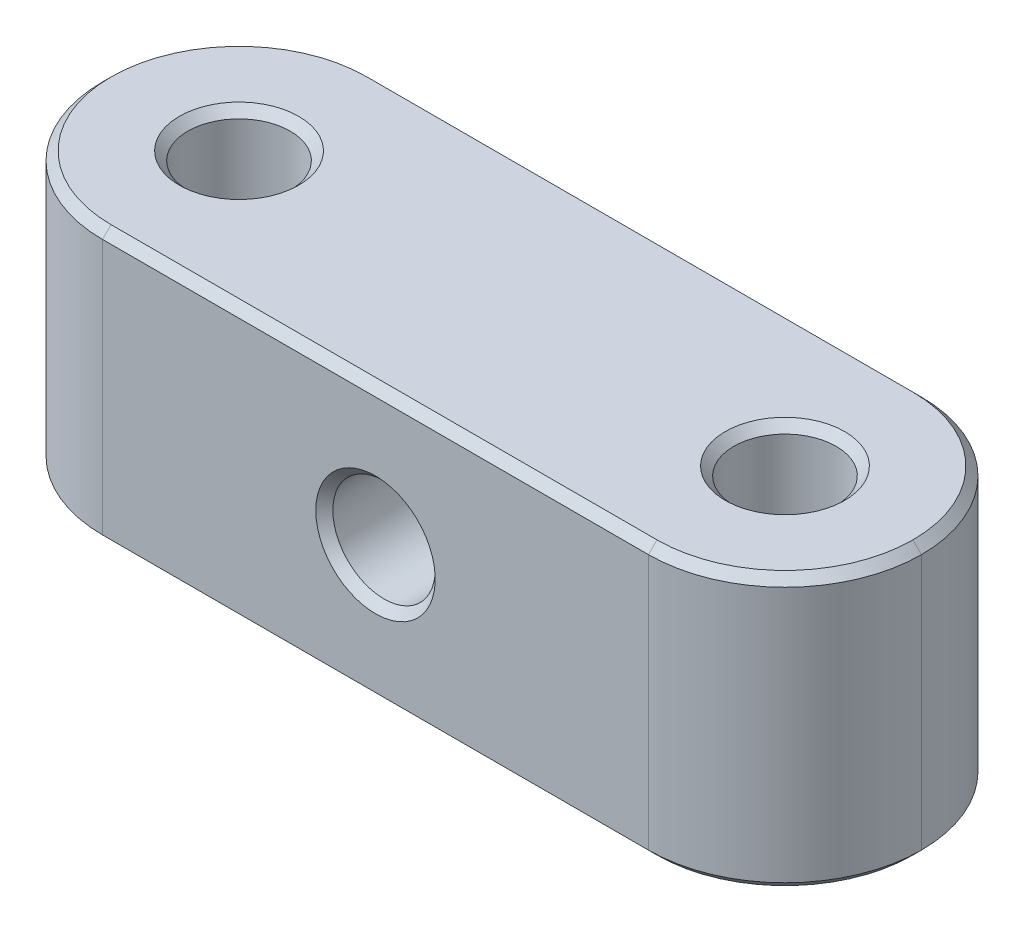
ISO-10303-21;
HEADER;
FILE_DESCRIPTION(('STEP AP214'),'2;1');
FILE_NAME('part.step','',(''),(''),'','','');
FILE_SCHEMA(('AUTOMOTIVE_DESIGN { 1 0 10303 214 1 1 1 1 }'));
ENDSEC;
DATA;
#1=APPLICATION_CONTEXT('core data for automotive mechanical design processes');
#2=APPLICATION_PROTOCOL_DEFINITION('international standard','automotive_design',2000,#1);
#3=PRODUCT_CONTEXT('',#1,'mechanical');
#4=PRODUCT('Part','Part','',(#3));
#5=PRODUCT_RELATED_PRODUCT_CATEGORY('part','',(#4));
#6=PRODUCT_DEFINITION_FORMATION('','',#4);
#7=PRODUCT_DEFINITION_CONTEXT('part definition',#1,'design');
#8=PRODUCT_DEFINITION('design','',#6,#7);
#9=PRODUCT_DEFINITION_SHAPE('','',#8);
#10=(LENGTH_UNIT() NAMED_UNIT(*) SI_UNIT(.MILLI.,.METRE.));
#11=(NAMED_UNIT(*) PLANE_ANGLE_UNIT() SI_UNIT($,.RADIAN.));
#12=(NAMED_UNIT(*) SI_UNIT($,.STERADIAN.) SOLID_ANGLE_UNIT());
#13=UNCERTAINTY_MEASURE_WITH_UNIT(LENGTH_MEASURE(1.E-05),#10,'distance_accuracy_value','');
#14=(GEOMETRIC_REPRESENTATION_CONTEXT(3) GLOBAL_UNCERTAINTY_ASSIGNED_CONTEXT((#13)) GLOBAL_UNIT_ASSIGNED_CONTEXT((#10,
#11,#12)) REPRESENTATION_CONTEXT('',''));
#15=CARTESIAN_POINT('',(0.,0.,0.));
#16=DIRECTION('',(0.,0.,1.));
#17=DIRECTION('',(1.,0.,0.));
#18=AXIS2_PLACEMENT_3D('',#15,#16,#17);
#19=CARTESIAN_POINT('',(0.,12.7,0.));
#20=DIRECTION('',(0.,-1.,0.));
#21=DIRECTION('',(0.,0.,-1.));
#22=AXIS2_PLACEMENT_3D('',#19,#20,#21);
#23=PLANE('',#22);
#24=CARTESIAN_POINT('',(31.75,12.7,-6.35));
#25=DIRECTION('',(0.,-1.,0.));
#26=DIRECTION('',(0.,0.,-1.));
#27=AXIS2_PLACEMENT_3D('',#24,#25,#26);
#28=CIRCLE('',#27,2.77812499999999);
#29=CARTESIAN_POINT('',(31.75,12.7,-9.12812499999999));
#30=VERTEX_POINT('',#29);
#31=EDGE_CURVE('E11',#30,#30,#28,.T.);
#32=ORIENTED_EDGE('',*,*,#31,.T.);
#33=EDGE_LOOP('',(#32));
#34=FACE_BOUND('',#33,.T.);
#35=CARTESIAN_POINT('',(6.35,12.7,-6.35));
#36=DIRECTION('',(0.,-1.,0.));
#37=DIRECTION('',(0.,0.,-1.));
#38=AXIS2_PLACEMENT_3D('',#35,#36,#37);
#39=CIRCLE('',#38,2.778125);
#40=CARTESIAN_POINT('',(6.35,12.7,-9.128125));
#41=VERTEX_POINT('',#40);
#42=EDGE_CURVE('E54',#41,#41,#39,.T.);
#43=ORIENTED_EDGE('',*,*,#42,.T.);
#44=EDGE_LOOP('',(#43));
#45=FACE_BOUND('',#44,.T.);
#46=CARTESIAN_POINT('',(31.75,12.7,-6.35));
#47=DIRECTION('',(0.,-1.,0.));
#48=DIRECTION('',(0.,0.,-1.));
#49=AXIS2_PLACEMENT_3D('',#46,#47,#48);
#50=CIRCLE('',#49,5.95312500000001);
#51=CARTESIAN_POINT('',(31.75,12.7,-0.396874999999991));
#52=VERTEX_POINT('',#51);
#53=CARTESIAN_POINT('',(37.703125,12.7,-6.35));
#54=VERTEX_POINT('',#53);
#55=EDGE_CURVE('E62',#52,#54,#50,.F.);
#56=ORIENTED_EDGE('',*,*,#55,.T.);
#57=CARTESIAN_POINT('',(31.75,12.7,-6.35));
#58=DIRECTION('',(0.,-1.,0.));
#59=DIRECTION('',(0.,0.,-1.));
#60=AXIS2_PLACEMENT_3D('',#57,#58,#59);
#61=CIRCLE('',#60,5.95312500000001);
#62=CARTESIAN_POINT('',(31.75,12.7,-12.303125));
#63=VERTEX_POINT('',#62);
#64=EDGE_CURVE('E216',#54,#63,#61,.F.);
#65=ORIENTED_EDGE('',*,*,#64,.T.);
#66=DIRECTION('',(-1.,0.,0.));
#67=VECTOR('',#66,1.);
#68=CARTESIAN_POINT('',(0.,12.7,-12.303125));
#69=LINE('',#68,#67);
#70=CARTESIAN_POINT('',(6.35,12.7,-12.303125));
#71=VERTEX_POINT('',#70);
#72=EDGE_CURVE('E229',#63,#71,#69,.T.);
#73=ORIENTED_EDGE('',*,*,#72,.T.);
#74=CARTESIAN_POINT('',(6.35,12.7,-6.35));
#75=DIRECTION('',(0.,-1.,0.));
#76=DIRECTION('',(0.,0.,-1.));
#77=AXIS2_PLACEMENT_3D('',#74,#75,#76);
#78=CIRCLE('',#77,5.95312500000001);
#79=CARTESIAN_POINT('',(0.396874999999991,12.7,-6.35));
#80=VERTEX_POINT('',#79);
#81=EDGE_CURVE('E226',#71,#80,#78,.F.);
#82=ORIENTED_EDGE('',*,*,#81,.T.);
#83=CARTESIAN_POINT('',(6.35,12.7,-6.35));
#84=DIRECTION('',(0.,-1.,0.));
#85=DIRECTION('',(0.,0.,-1.));
#86=AXIS2_PLACEMENT_3D('',#83,#84,#85);
#87=CIRCLE('',#86,5.95312500000001);
#88=CARTESIAN_POINT('',(6.35,12.7,-0.396874999999991));
#89=VERTEX_POINT('',#88);
#90=EDGE_CURVE('E223',#80,#89,#87,.F.);
#91=ORIENTED_EDGE('',*,*,#90,.T.);
#92=DIRECTION('',(1.,0.,0.));
#93=VECTOR('',#92,1.);
#94=CARTESIAN_POINT('',(0.,12.7,-0.396874999999991));
#95=LINE('',#94,#93);
#96=EDGE_CURVE('E67',#89,#52,#95,.T.);
#97=ORIENTED_EDGE('',*,*,#96,.T.);
#98=EDGE_LOOP('',(#56,#65,#73,#82,#91,#97));
#99=FACE_BOUND('',#98,.T.);
#100=ADVANCED_FACE('F43',(#34,#45,#99),#23,.F.);
#101=CARTESIAN_POINT('',(0.,0.,0.));
#102=DIRECTION('',(0.,-1.,0.));
#103=DIRECTION('',(0.,0.,-1.));
#104=AXIS2_PLACEMENT_3D('',#101,#102,#103);
#105=PLANE('',#104);
#106=CARTESIAN_POINT('',(31.75,0.,-6.35));
#107=DIRECTION('',(0.,-1.,0.));
#108=DIRECTION('',(0.,0.,-1.));
#109=AXIS2_PLACEMENT_3D('',#106,#107,#108);
#110=CIRCLE('',#109,2.778125);
#111=CARTESIAN_POINT('',(31.75,0.,-9.128125));
#112=VERTEX_POINT('',#111);
#113=EDGE_CURVE('E268',#112,#112,#110,.F.);
#114=ORIENTED_EDGE('',*,*,#113,.T.);
#115=EDGE_LOOP('',(#114));
#116=FACE_BOUND('',#115,.T.);
#117=CARTESIAN_POINT('',(31.75,0.,-6.35));
#118=DIRECTION('',(0.,-1.,0.));
#119=DIRECTION('',(0.,0.,-1.));
#120=AXIS2_PLACEMENT_3D('',#117,#118,#119);
#121=CIRCLE('',#120,5.953125);
#122=CARTESIAN_POINT('',(37.703125,0.,-6.35));
#123=VERTEX_POINT('',#122);
#124=CARTESIAN_POINT('',(31.75,0.,-0.396874999999996));
#125=VERTEX_POINT('',#124);
#126=EDGE_CURVE('E276',#123,#125,#121,.T.);
#127=ORIENTED_EDGE('',*,*,#126,.T.);
#128=DIRECTION('',(-1.,0.,0.));
#129=VECTOR('',#128,1.);
#130=CARTESIAN_POINT('',(6.35,0.,-0.396874999999995));
#131=LINE('',#130,#129);
#132=CARTESIAN_POINT('',(6.35,0.,-0.396874999999995));
#133=VERTEX_POINT('',#132);
#134=EDGE_CURVE('E272',#125,#133,#131,.T.);
#135=ORIENTED_EDGE('',*,*,#134,.T.);
#136=CARTESIAN_POINT('',(6.35,0.,-6.35));
#137=DIRECTION('',(0.,-1.,0.));
#138=DIRECTION('',(0.,0.,-1.));
#139=AXIS2_PLACEMENT_3D('',#136,#137,#138);
#140=CIRCLE('',#139,5.95312500000001);
#141=CARTESIAN_POINT('',(0.396874999999995,0.,-6.35));
#142=VERTEX_POINT('',#141);
#143=EDGE_CURVE('E288',#133,#142,#140,.T.);
#144=ORIENTED_EDGE('',*,*,#143,.T.);
#145=CARTESIAN_POINT('',(6.35,0.,-6.35));
#146=DIRECTION('',(0.,-1.,0.));
#147=DIRECTION('',(0.,0.,-1.));
#148=AXIS2_PLACEMENT_3D('',#145,#146,#147);
#149=CIRCLE('',#148,5.95312500000001);
#150=CARTESIAN_POINT('',(6.35,0.,-12.303125));
#151=VERTEX_POINT('',#150);
#152=EDGE_CURVE('E285',#142,#151,#149,.T.);
#153=ORIENTED_EDGE('',*,*,#152,.T.);
#154=DIRECTION('',(1.,0.,0.));
#155=VECTOR('',#154,1.);
#156=CARTESIAN_POINT('',(31.75,0.,-12.303125));
#157=LINE('',#156,#155);
#158=CARTESIAN_POINT('',(31.75,0.,-12.303125));
#159=VERTEX_POINT('',#158);
#160=EDGE_CURVE('E282',#151,#159,#157,.T.);
#161=ORIENTED_EDGE('',*,*,#160,.T.);
#162=CARTESIAN_POINT('',(31.75,0.,-6.35));
#163=DIRECTION('',(0.,-1.,0.));
#164=DIRECTION('',(0.,0.,-1.));
#165=AXIS2_PLACEMENT_3D('',#162,#163,#164);
#166=CIRCLE('',#165,5.953125);
#167=EDGE_CURVE('E279',#159,#123,#166,.T.);
#168=ORIENTED_EDGE('',*,*,#167,.T.);
#169=EDGE_LOOP('',(#127,#135,#144,#153,#161,#168));
#170=FACE_BOUND('',#169,.T.);
#171=CARTESIAN_POINT('',(6.35,0.,-6.35));
#172=DIRECTION('',(0.,-1.,0.));
#173=DIRECTION('',(0.,0.,-1.));
#174=AXIS2_PLACEMENT_3D('',#171,#172,#173);
#175=CIRCLE('',#174,2.778125);
#176=CARTESIAN_POINT('',(6.35,0.,-9.128125));
#177=VERTEX_POINT('',#176);
#178=EDGE_CURVE('E291',#177,#177,#175,.F.);
#179=ORIENTED_EDGE('',*,*,#178,.T.);
#180=EDGE_LOOP('',(#179));
#181=FACE_BOUND('',#180,.T.);
#182=ADVANCED_FACE('F355',(#116,#170,#181),#105,.T.);
#183=CARTESIAN_POINT('',(0.,12.7,0.));
#184=DIRECTION('',(0.,0.,-1.));
#185=DIRECTION('',(-1.,0.,0.));
#186=AXIS2_PLACEMENT_3D('',#183,#184,#185);
#187=PLANE('',#186);
#188=CARTESIAN_POINT('',(19.05,6.35,0.));
#189=DIRECTION('',(0.,0.,-1.));
#190=DIRECTION('',(-1.,0.,0.));
#191=AXIS2_PLACEMENT_3D('',#188,#189,#190);
#192=CIRCLE('',#191,2.77812500000001);
#193=CARTESIAN_POINT('',(16.271875,6.35,0.));
#194=VERTEX_POINT('',#193);
#195=EDGE_CURVE('E313',#194,#194,#192,.T.);
#196=ORIENTED_EDGE('',*,*,#195,.T.);
#197=EDGE_LOOP('',(#196));
#198=FACE_BOUND('',#197,.T.);
#199=DIRECTION('',(0.,-1.,0.));
#200=VECTOR('',#199,1.);
#201=CARTESIAN_POINT('',(6.35,12.7,0.));
#202=LINE('',#201,#200);
#203=CARTESIAN_POINT('',(6.35,12.303125,0.));
#204=VERTEX_POINT('',#203);
#205=CARTESIAN_POINT('',(6.35,0.396874999999998,0.));
#206=VERTEX_POINT('',#205);
#207=EDGE_CURVE('E141',#204,#206,#202,.T.);
#208=ORIENTED_EDGE('',*,*,#207,.T.);
#209=DIRECTION('',(1.,0.,0.));
#210=VECTOR('',#209,1.);
#211=CARTESIAN_POINT('',(31.75,0.396874999999998,0.));
#212=LINE('',#211,#210);
#213=CARTESIAN_POINT('',(31.75,0.396874999999998,0.));
#214=VERTEX_POINT('',#213);
#215=EDGE_CURVE('E149',#206,#214,#212,.T.);
#216=ORIENTED_EDGE('',*,*,#215,.T.);
#217=DIRECTION('',(0.,-1.,0.));
#218=VECTOR('',#217,1.);
#219=CARTESIAN_POINT('',(31.75,12.7,0.));
#220=LINE('',#219,#218);
#221=CARTESIAN_POINT('',(31.75,12.303125,0.));
#222=VERTEX_POINT('',#221);
#223=EDGE_CURVE('E144',#214,#222,#220,.F.);
#224=ORIENTED_EDGE('',*,*,#223,.T.);
#225=DIRECTION('',(-1.,0.,0.));
#226=VECTOR('',#225,1.);
#227=CARTESIAN_POINT('',(0.,12.303125,0.));
#228=LINE('',#227,#226);
#229=EDGE_CURVE('E137',#222,#204,#228,.T.);
#230=ORIENTED_EDGE('',*,*,#229,.T.);
#231=EDGE_LOOP('',(#208,#216,#224,#230));
#232=FACE_BOUND('',#231,.T.);
#233=ADVANCED_FACE('F139',(#198,#232),#187,.F.);
#234=CARTESIAN_POINT('',(0.,12.7,-12.7));
#235=DIRECTION('',(0.,0.,1.));
#236=DIRECTION('',(1.,0.,0.));
#237=AXIS2_PLACEMENT_3D('',#234,#235,#236);
#238=PLANE('',#237);
#239=CARTESIAN_POINT('',(19.05,6.35,-12.7));
#240=DIRECTION('',(0.,0.,1.));
#241=DIRECTION('',(1.,0.,0.));
#242=AXIS2_PLACEMENT_3D('',#239,#240,#241);
#243=CIRCLE('',#242,2.778125);
#244=CARTESIAN_POINT('',(21.828125,6.35,-12.7));
#245=VERTEX_POINT('',#244);
#246=EDGE_CURVE('E295',#245,#245,#243,.T.);
#247=ORIENTED_EDGE('',*,*,#246,.T.);
#248=EDGE_LOOP('',(#247));
#249=FACE_BOUND('',#248,.T.);
#250=DIRECTION('',(0.,-1.,0.));
#251=VECTOR('',#250,1.);
#252=CARTESIAN_POINT('',(31.75,12.7,-12.7));
#253=LINE('',#252,#251);
#254=CARTESIAN_POINT('',(31.75,12.303125,-12.7));
#255=VERTEX_POINT('',#254);
#256=CARTESIAN_POINT('',(31.75,0.396874999999998,-12.7));
#257=VERTEX_POINT('',#256);
#258=EDGE_CURVE('E324',#255,#257,#253,.T.);
#259=ORIENTED_EDGE('',*,*,#258,.T.);
#260=DIRECTION('',(-1.,0.,0.));
#261=VECTOR('',#260,1.);
#262=CARTESIAN_POINT('',(6.35,0.396874999999998,-12.7));
#263=LINE('',#262,#261);
#264=CARTESIAN_POINT('',(6.35,0.396874999999998,-12.7));
#265=VERTEX_POINT('',#264);
#266=EDGE_CURVE('E299',#257,#265,#263,.T.);
#267=ORIENTED_EDGE('',*,*,#266,.T.);
#268=DIRECTION('',(0.,-1.,0.));
#269=VECTOR('',#268,1.);
#270=CARTESIAN_POINT('',(6.35,12.7,-12.7));
#271=LINE('',#270,#269);
#272=CARTESIAN_POINT('',(6.35,12.303125,-12.7));
#273=VERTEX_POINT('',#272);
#274=EDGE_CURVE('E328',#265,#273,#271,.F.);
#275=ORIENTED_EDGE('',*,*,#274,.T.);
#276=DIRECTION('',(1.,0.,0.));
#277=VECTOR('',#276,1.);
#278=CARTESIAN_POINT('',(0.,12.303125,-12.7));
#279=LINE('',#278,#277);
#280=EDGE_CURVE('E302',#273,#255,#279,.T.);
#281=ORIENTED_EDGE('',*,*,#280,.T.);
#282=EDGE_LOOP('',(#259,#267,#275,#281));
#283=FACE_BOUND('',#282,.T.);
#284=ADVANCED_FACE('F337',(#249,#283),#238,.F.);
#285=CARTESIAN_POINT('',(6.35,12.7,-6.35));
#286=DIRECTION('',(0.,-1.,0.));
#287=DIRECTION('',(0.,0.,-1.));
#288=AXIS2_PLACEMENT_3D('',#285,#286,#287);
#289=CYLINDRICAL_SURFACE('',#288,2.38125);
#290=CARTESIAN_POINT('',(6.35,0.396875,-6.35));
#291=DIRECTION('',(0.,-1.,0.));
#292=DIRECTION('',(0.,0.,-1.));
#293=AXIS2_PLACEMENT_3D('',#290,#291,#292);
#294=CIRCLE('',#293,2.38125);
#295=CARTESIAN_POINT('',(6.35,0.396875,-8.73125));
#296=VERTEX_POINT('',#295);
#297=EDGE_CURVE('E232',#296,#296,#294,.T.);
#298=ORIENTED_EDGE('',*,*,#297,.T.);
#299=EDGE_LOOP('',(#298));
#300=FACE_BOUND('',#299,.T.);
#301=CARTESIAN_POINT('',(6.35,12.303125,-6.35));
#302=DIRECTION('',(0.,-1.,0.));
#303=DIRECTION('',(0.,0.,-1.));
#304=AXIS2_PLACEMENT_3D('',#301,#302,#303);
#305=CIRCLE('',#304,2.38125);
#306=CARTESIAN_POINT('',(6.35,12.303125,-8.73125));
#307=VERTEX_POINT('',#306);
#308=EDGE_CURVE('E236',#307,#307,#305,.F.);
#309=ORIENTED_EDGE('',*,*,#308,.T.);
#310=EDGE_LOOP('',(#309));
#311=FACE_BOUND('',#310,.T.);
#312=ADVANCED_FACE('F407',(#300,#311),#289,.F.);
#313=CARTESIAN_POINT('',(31.75,12.7,-6.35));
#314=DIRECTION('',(0.,-1.,0.));
#315=DIRECTION('',(0.,0.,-1.));
#316=AXIS2_PLACEMENT_3D('',#313,#314,#315);
#317=CYLINDRICAL_SURFACE('',#316,2.38125);
#318=CARTESIAN_POINT('',(31.75,0.396875000000001,-6.35));
#319=DIRECTION('',(0.,-1.,0.));
#320=DIRECTION('',(0.,0.,-1.));
#321=AXIS2_PLACEMENT_3D('',#318,#319,#320);
#322=CIRCLE('',#321,2.38125);
#323=CARTESIAN_POINT('',(31.75,0.396875000000001,-8.73125));
#324=VERTEX_POINT('',#323);
#325=EDGE_CURVE('E260',#324,#324,#322,.T.);
#326=ORIENTED_EDGE('',*,*,#325,.T.);
#327=EDGE_LOOP('',(#326));
#328=FACE_BOUND('',#327,.T.);
#329=CARTESIAN_POINT('',(31.75,12.303125,-6.35));
#330=DIRECTION('',(0.,-1.,0.));
#331=DIRECTION('',(0.,0.,-1.));
#332=AXIS2_PLACEMENT_3D('',#329,#330,#331);
#333=CIRCLE('',#332,2.38125);
#334=CARTESIAN_POINT('',(31.75,12.303125,-8.73125));
#335=VERTEX_POINT('',#334);
#336=EDGE_CURVE('E264',#335,#335,#333,.F.);
#337=ORIENTED_EDGE('',*,*,#336,.T.);
#338=EDGE_LOOP('',(#337));
#339=FACE_BOUND('',#338,.T.);
#340=ADVANCED_FACE('F613',(#328,#339),#317,.F.);
#341=CARTESIAN_POINT('',(19.05,6.35,-12.7));
#342=DIRECTION('',(0.,0.,1.));
#343=DIRECTION('',(1.,0.,0.));
#344=AXIS2_PLACEMENT_3D('',#341,#342,#343);
#345=CYLINDRICAL_SURFACE('',#344,2.38125);
#346=CARTESIAN_POINT('',(19.05,6.35,-0.396875000000005));
#347=DIRECTION('',(0.,0.,-1.));
#348=DIRECTION('',(-1.,0.,0.));
#349=AXIS2_PLACEMENT_3D('',#346,#347,#348);
#350=CIRCLE('',#349,2.38125);
#351=CARTESIAN_POINT('',(16.66875,6.35,-0.396875000000005));
#352=VERTEX_POINT('',#351);
#353=EDGE_CURVE('E305',#352,#352,#350,.F.);
#354=ORIENTED_EDGE('',*,*,#353,.T.);
#355=EDGE_LOOP('',(#354));
#356=FACE_BOUND('',#355,.T.);
#357=CARTESIAN_POINT('',(19.05,6.35,-12.303125));
#358=DIRECTION('',(0.,0.,1.));
#359=DIRECTION('',(1.,0.,0.));
#360=AXIS2_PLACEMENT_3D('',#357,#358,#359);
#361=CIRCLE('',#360,2.38125);
#362=CARTESIAN_POINT('',(21.43125,6.35,-12.303125));
#363=VERTEX_POINT('',#362);
#364=EDGE_CURVE('E309',#363,#363,#361,.F.);
#365=ORIENTED_EDGE('',*,*,#364,.T.);
#366=EDGE_LOOP('',(#365));
#367=FACE_BOUND('',#366,.T.);
#368=ADVANCED_FACE('F420',(#356,#367),#345,.F.);
#369=CARTESIAN_POINT('',(6.35,12.7,-6.35));
#370=DIRECTION('',(0.,-1.,0.));
#371=DIRECTION('',(0.,0.,-1.));
#372=AXIS2_PLACEMENT_3D('',#369,#370,#371);
#373=CYLINDRICAL_SURFACE('',#372,6.35);
#374=DIRECTION('',(0.,-1.,0.));
#375=VECTOR('',#374,1.);
#376=CARTESIAN_POINT('',(0.,12.7,-6.35));
#377=LINE('',#376,#375);
#378=CARTESIAN_POINT('',(0.,0.396874999999998,-6.35));
#379=VERTEX_POINT('',#378);
#380=CARTESIAN_POINT('',(0.,12.303125,-6.35));
#381=VERTEX_POINT('',#380);
#382=EDGE_CURVE('E322',#379,#381,#377,.F.);
#383=ORIENTED_EDGE('',*,*,#382,.F.);
#384=CARTESIAN_POINT('',(6.35,0.396874999999998,-6.35));
#385=DIRECTION('',(0.,-1.,0.));
#386=DIRECTION('',(0.,0.,-1.));
#387=AXIS2_PLACEMENT_3D('',#384,#385,#386);
#388=CIRCLE('',#387,6.35);
#389=EDGE_CURVE('E158',#379,#206,#388,.F.);
#390=ORIENTED_EDGE('',*,*,#389,.T.);
#391=ORIENTED_EDGE('',*,*,#207,.F.);
#392=CARTESIAN_POINT('',(6.35,12.303125,-6.35));
#393=DIRECTION('',(0.,-1.,0.));
#394=DIRECTION('',(0.,0.,-1.));
#395=AXIS2_PLACEMENT_3D('',#392,#393,#394);
#396=CIRCLE('',#395,6.35);
#397=EDGE_CURVE('E155',#204,#381,#396,.T.);
#398=ORIENTED_EDGE('',*,*,#397,.T.);
#399=EDGE_LOOP('',(#383,#390,#391,#398));
#400=FACE_BOUND('',#399,.T.);
#401=ADVANCED_FACE('F154',(#400),#373,.T.);
#402=CARTESIAN_POINT('',(6.35,12.7,-6.35));
#403=DIRECTION('',(0.,-1.,0.));
#404=DIRECTION('',(0.,0.,-1.));
#405=AXIS2_PLACEMENT_3D('',#402,#403,#404);
#406=CYLINDRICAL_SURFACE('',#405,6.35);
#407=ORIENTED_EDGE('',*,*,#274,.F.);
#408=CARTESIAN_POINT('',(6.35,0.396874999999998,-6.35));
#409=DIRECTION('',(0.,-1.,0.));
#410=DIRECTION('',(0.,0.,-1.));
#411=AXIS2_PLACEMENT_3D('',#408,#409,#410);
#412=CIRCLE('',#411,6.35);
#413=EDGE_CURVE('E169',#265,#379,#412,.F.);
#414=ORIENTED_EDGE('',*,*,#413,.T.);
#415=ORIENTED_EDGE('',*,*,#382,.T.);
#416=CARTESIAN_POINT('',(6.35,12.303125,-6.35));
#417=DIRECTION('',(0.,-1.,0.));
#418=DIRECTION('',(0.,0.,-1.));
#419=AXIS2_PLACEMENT_3D('',#416,#417,#418);
#420=CIRCLE('',#419,6.35);
#421=EDGE_CURVE('E244',#381,#273,#420,.T.);
#422=ORIENTED_EDGE('',*,*,#421,.T.);
#423=EDGE_LOOP('',(#407,#414,#415,#422));
#424=FACE_BOUND('',#423,.T.);
#425=ADVANCED_FACE('F363',(#424),#406,.T.);
#426=CARTESIAN_POINT('',(31.75,12.7,-6.35));
#427=DIRECTION('',(0.,-1.,0.));
#428=DIRECTION('',(0.,0.,-1.));
#429=AXIS2_PLACEMENT_3D('',#426,#427,#428);
#430=CYLINDRICAL_SURFACE('',#429,6.35);
#431=ORIENTED_EDGE('',*,*,#223,.F.);
#432=CARTESIAN_POINT('',(31.75,0.396874999999998,-6.35));
#433=DIRECTION('',(0.,-1.,0.));
#434=DIRECTION('',(0.,0.,-1.));
#435=AXIS2_PLACEMENT_3D('',#432,#433,#434);
#436=CIRCLE('',#435,6.35);
#437=CARTESIAN_POINT('',(38.1,0.396874999999998,-6.35));
#438=VERTEX_POINT('',#437);
#439=EDGE_CURVE('E254',#214,#438,#436,.F.);
#440=ORIENTED_EDGE('',*,*,#439,.T.);
#441=DIRECTION('',(0.,-1.,0.));
#442=VECTOR('',#441,1.);
#443=CARTESIAN_POINT('',(38.1,12.7,-6.35));
#444=LINE('',#443,#442);
#445=CARTESIAN_POINT('',(38.1,12.303125,-6.35));
#446=VERTEX_POINT('',#445);
#447=EDGE_CURVE('E198',#446,#438,#444,.T.);
#448=ORIENTED_EDGE('',*,*,#447,.F.);
#449=CARTESIAN_POINT('',(31.75,12.303125,-6.35));
#450=DIRECTION('',(0.,-1.,0.));
#451=DIRECTION('',(0.,0.,-1.));
#452=AXIS2_PLACEMENT_3D('',#449,#450,#451);
#453=CIRCLE('',#452,6.35);
#454=EDGE_CURVE('E257',#446,#222,#453,.T.);
#455=ORIENTED_EDGE('',*,*,#454,.T.);
#456=EDGE_LOOP('',(#431,#440,#448,#455));
#457=FACE_BOUND('',#456,.T.);
#458=ADVANCED_FACE('F377',(#457),#430,.T.);
#459=CARTESIAN_POINT('',(31.75,12.7,-6.35));
#460=DIRECTION('',(0.,-1.,0.));
#461=DIRECTION('',(0.,0.,-1.));
#462=AXIS2_PLACEMENT_3D('',#459,#460,#461);
#463=CYLINDRICAL_SURFACE('',#462,6.35);
#464=ORIENTED_EDGE('',*,*,#447,.T.);
#465=CARTESIAN_POINT('',(31.75,0.396874999999998,-6.35));
#466=DIRECTION('',(0.,-1.,0.));
#467=DIRECTION('',(0.,0.,-1.));
#468=AXIS2_PLACEMENT_3D('',#465,#466,#467);
#469=CIRCLE('',#468,6.35);
#470=EDGE_CURVE('E247',#438,#257,#469,.F.);
#471=ORIENTED_EDGE('',*,*,#470,.T.);
#472=ORIENTED_EDGE('',*,*,#258,.F.);
#473=CARTESIAN_POINT('',(31.75,12.303125,-6.35));
#474=DIRECTION('',(0.,-1.,0.));
#475=DIRECTION('',(0.,0.,-1.));
#476=AXIS2_PLACEMENT_3D('',#473,#474,#475);
#477=CIRCLE('',#476,6.35);
#478=EDGE_CURVE('E250',#255,#446,#477,.T.);
#479=ORIENTED_EDGE('',*,*,#478,.T.);
#480=EDGE_LOOP('',(#464,#471,#472,#479));
#481=FACE_BOUND('',#480,.T.);
#482=ADVANCED_FACE('F375',(#481),#463,.T.);
#483=CARTESIAN_POINT('',(19.05,6.35,0.));
#484=DIRECTION('',(0.,0.,1.));
#485=DIRECTION('',(1.,0.,0.));
#486=AXIS2_PLACEMENT_3D('',#483,#484,#485);
#487=CONICAL_SURFACE('',#486,2.77812500000001,0.785398163397452);
#488=ORIENTED_EDGE('',*,*,#353,.F.);
#489=EDGE_LOOP('',(#488));
#490=FACE_BOUND('',#489,.T.);
#491=ORIENTED_EDGE('',*,*,#195,.F.);
#492=EDGE_LOOP('',(#491));
#493=FACE_BOUND('',#492,.T.);
#494=ADVANCED_FACE('F423',(#490,#493),#487,.F.);
#495=CARTESIAN_POINT('',(19.05,6.35,-12.7));
#496=DIRECTION('',(0.,0.,-1.));
#497=DIRECTION('',(-1.,0.,0.));
#498=AXIS2_PLACEMENT_3D('',#495,#496,#497);
#499=CONICAL_SURFACE('',#498,2.778125,0.785398163397452);
#500=ORIENTED_EDGE('',*,*,#364,.F.);
#501=EDGE_LOOP('',(#500));
#502=FACE_BOUND('',#501,.T.);
#503=ORIENTED_EDGE('',*,*,#246,.F.);
#504=EDGE_LOOP('',(#503));
#505=FACE_BOUND('',#504,.T.);
#506=ADVANCED_FACE('F432',(#502,#505),#499,.F.);
#507=CARTESIAN_POINT('',(31.75,0.,-6.35));
#508=DIRECTION('',(0.,-1.,0.));
#509=DIRECTION('',(0.,0.,-1.));
#510=AXIS2_PLACEMENT_3D('',#507,#508,#509);
#511=CONICAL_SURFACE('',#510,2.778125,0.785398163397445);
#512=CARTESIAN_POINT('',(31.75,0.396875000000001,-8.73125));
#513=CARTESIAN_POINT('',(31.75,0.392740885416668,-8.73538411458333));
#514=CARTESIAN_POINT('',(31.75,0.388606770833334,-8.73951822916666));
#515=CARTESIAN_POINT('',(31.75,0.380338541666668,-8.74778645833333));
#516=CARTESIAN_POINT('',(31.75,0.376204427083335,-8.75192057291667));
#517=CARTESIAN_POINT('',(31.75,0.367936197916668,-8.76018880208333));
#518=CARTESIAN_POINT('',(31.75,0.363802083333335,-8.76432291666666));
#519=CARTESIAN_POINT('',(31.75,0.355533854166668,-8.77259114583333));
#520=CARTESIAN_POINT('',(31.75,0.351399739583335,-8.77672526041667));
#521=CARTESIAN_POINT('',(31.75,0.343131510416668,-8.78499348958333));
#522=CARTESIAN_POINT('',(31.75,0.338997395833334,-8.78912760416666));
#523=CARTESIAN_POINT('',(31.75,0.330729166666668,-8.79739583333333));
#524=CARTESIAN_POINT('',(31.75,0.326595052083334,-8.80152994791666));
#525=CARTESIAN_POINT('',(31.75,0.318326822916668,-8.80979817708333));
#526=CARTESIAN_POINT('',(31.75,0.314192708333335,-8.81393229166667));
#527=CARTESIAN_POINT('',(31.75,0.305924479166668,-8.82220052083333));
#528=CARTESIAN_POINT('',(31.75,0.301790364583334,-8.82633463541666));
#529=CARTESIAN_POINT('',(31.75,0.293522135416668,-8.83460286458333));
#530=CARTESIAN_POINT('',(31.75,0.289388020833334,-8.83873697916667));
#531=CARTESIAN_POINT('',(31.75,0.281119791666668,-8.84700520833333));
#532=CARTESIAN_POINT('',(31.75,0.276985677083335,-8.85113932291666));
#533=CARTESIAN_POINT('',(31.75,0.268717447916668,-8.85940755208333));
#534=CARTESIAN_POINT('',(31.75,0.264583333333334,-8.86354166666666));
#535=CARTESIAN_POINT('',(31.75,0.256315104166667,-8.87180989583333));
#536=CARTESIAN_POINT('',(31.75,0.252180989583334,-8.87594401041666));
#537=CARTESIAN_POINT('',(31.75,0.243912760416668,-8.88421223958333));
#538=CARTESIAN_POINT('',(31.75,0.239778645833334,-8.88834635416666));
#539=CARTESIAN_POINT('',(31.75,0.231510416666668,-8.89661458333333));
#540=CARTESIAN_POINT('',(31.75,0.227376302083334,-8.90074869791666));
#541=CARTESIAN_POINT('',(31.75,0.219108072916667,-8.90901692708333));
#542=CARTESIAN_POINT('',(31.75,0.214973958333334,-8.91315104166666));
#543=CARTESIAN_POINT('',(31.75,0.206705729166668,-8.92141927083333));
#544=CARTESIAN_POINT('',(31.75,0.202571614583334,-8.92555338541666));
#545=CARTESIAN_POINT('',(31.75,0.194303385416667,-8.93382161458333));
#546=CARTESIAN_POINT('',(31.75,0.190169270833334,-8.93795572916666));
#547=CARTESIAN_POINT('',(31.75,0.181901041666667,-8.94622395833333));
#548=CARTESIAN_POINT('',(31.75,0.177766927083334,-8.95035807291666));
#549=CARTESIAN_POINT('',(31.75,0.169498697916667,-8.95862630208333));
#550=CARTESIAN_POINT('',(31.75,0.165364583333334,-8.96276041666667));
#551=CARTESIAN_POINT('',(31.75,0.157096354166667,-8.97102864583333));
#552=CARTESIAN_POINT('',(31.75,0.152962239583334,-8.97516276041666));
#553=CARTESIAN_POINT('',(31.75,0.144694010416667,-8.98343098958333));
#554=CARTESIAN_POINT('',(31.75,0.140559895833334,-8.98756510416666));
#555=CARTESIAN_POINT('',(31.75,0.132291666666667,-8.99583333333333));
#556=CARTESIAN_POINT('',(31.75,0.128157552083334,-8.99996744791667));
#557=CARTESIAN_POINT('',(31.75,0.119889322916667,-9.00823567708333));
#558=CARTESIAN_POINT('',(31.75,0.115755208333334,-9.01236979166666));
#559=CARTESIAN_POINT('',(31.75,0.107486979166667,-9.02063802083333));
#560=CARTESIAN_POINT('',(31.75,0.103352864583334,-9.02477213541667));
#561=CARTESIAN_POINT('',(31.75,0.0950846354166671,-9.03304036458333));
#562=CARTESIAN_POINT('',(31.75,0.0909505208333338,-9.03717447916667));
#563=CARTESIAN_POINT('',(31.75,0.082682291666667,-9.04544270833333));
#564=CARTESIAN_POINT('',(31.75,0.0785481770833335,-9.04957682291666));
#565=CARTESIAN_POINT('',(31.75,0.0702799479166667,-9.05784505208333));
#566=CARTESIAN_POINT('',(31.75,0.0661458333333334,-9.06197916666666));
#567=CARTESIAN_POINT('',(31.75,0.057877604166667,-9.07024739583333));
#568=CARTESIAN_POINT('',(31.75,0.0537434895833337,-9.07438151041666));
#569=CARTESIAN_POINT('',(31.75,0.0454752604166669,-9.08264973958333));
#570=CARTESIAN_POINT('',(31.75,0.0413411458333333,-9.08678385416666));
#571=CARTESIAN_POINT('',(31.75,0.0330729166666666,-9.09505208333333));
#572=CARTESIAN_POINT('',(31.75,0.0289388020833335,-9.09918619791666));
#573=CARTESIAN_POINT('',(31.75,0.0206705729166669,-9.10745442708333));
#574=CARTESIAN_POINT('',(31.75,0.0165364583333334,-9.11158854166666));
#575=CARTESIAN_POINT('',(31.75,0.00826822916666638,-9.11985677083333));
#576=CARTESIAN_POINT('',(31.75,0.00413411458333287,-9.12399088541666));
#577=CARTESIAN_POINT('',(31.75,0.,-9.128125));
#578=B_SPLINE_CURVE_WITH_KNOTS('',3,(#512,#513,#514,#515,#516,#517,#518,#519,#520,#521,#522,
#523,#524,#525,#526,#527,#528,#529,#530,#531,#532,#533,#534,#535,#536,#537,#538,#539,#540,#541,
#542,#543,#544,#545,#546,#547,#548,#549,#550,#551,#552,#553,#554,#555,#556,#557,#558,#559,#560,
#561,#562,#563,#564,#565,#566,#567,#568,#569,#570,#571,#572,#573,#574,#575,#576,#577),
.UNSPECIFIED.,.F.,.F.,(4,2,2,2,2,2,2,2,2,2,2,2,2,2,2,2,2,2,2,2,2,2,2,2,2,2,2,2,2,2,2,2,4),(0.,
0.0175395627364624,0.035079125472926,0.0526186882093884,0.0701582509458521,0.0876978136823145,
0.105237376418778,0.122776939155242,0.140316501891704,0.157856064628168,0.175395627364631,
0.192935190101094,0.210474752837558,0.228014315574021,0.245553878310484,0.263093441046947,
0.280633003783411,0.298172566519873,0.315712129256337,0.3332516919928,0.350791254729263,
0.368330817465726,0.38587038020219,0.403409942938652,0.420949505675116,0.43848906841158,
0.456028631148042,0.473568193884506,0.491107756620969,0.508647319357432,0.526186882093895,
0.543726444830358,0.561266007566821),.UNSPECIFIED.);
#579=EDGE_CURVE('BSEAM439',#324,#112,#578,.T.);
#580=ORIENTED_EDGE('',*,*,#325,.F.);
#581=ORIENTED_EDGE('',*,*,#113,.F.);
#582=ORIENTED_EDGE('',*,*,#579,.T.);
#583=ORIENTED_EDGE('',*,*,#579,.F.);
#584=EDGE_LOOP('',(#580,#582,#581,#583));
#585=FACE_BOUND('',#584,.T.);
#586=ADVANCED_FACE('F439',(#585),#511,.F.);
#587=CARTESIAN_POINT('',(0.,0.396874999999998,-12.7));
#588=DIRECTION('',(0.,-0.707106781186544,-0.707106781186551));
#589=DIRECTION('',(1.,0.,0.));
#590=AXIS2_PLACEMENT_3D('',#587,#588,#589);
#591=PLANE('',#590);
#592=DIRECTION('',(0.,0.707106781186551,-0.707106781186544));
#593=VECTOR('',#592,1.);
#594=CARTESIAN_POINT('',(31.75,0.,-12.303125));
#595=LINE('',#594,#593);
#596=EDGE_CURVE('E199',#159,#257,#595,.T.);
#597=ORIENTED_EDGE('',*,*,#596,.F.);
#598=ORIENTED_EDGE('',*,*,#160,.F.);
#599=DIRECTION('',(0.,-0.707106781186551,0.707106781186544));
#600=VECTOR('',#599,1.);
#601=CARTESIAN_POINT('',(6.35,0.396874999999998,-12.7));
#602=LINE('',#601,#600);
#603=EDGE_CURVE('E194',#265,#151,#602,.T.);
#604=ORIENTED_EDGE('',*,*,#603,.F.);
#605=ORIENTED_EDGE('',*,*,#266,.F.);
#606=EDGE_LOOP('',(#597,#598,#604,#605));
#607=FACE_BOUND('',#606,.T.);
#608=ADVANCED_FACE('F345',(#607),#591,.T.);
#609=CARTESIAN_POINT('',(6.35,0.,-6.35));
#610=DIRECTION('',(0.,1.,0.));
#611=DIRECTION('',(0.,0.,1.));
#612=AXIS2_PLACEMENT_3D('',#609,#610,#611);
#613=CONICAL_SURFACE('',#612,5.95312500000001,0.785398163397444);
#614=ORIENTED_EDGE('',*,*,#603,.T.);
#615=ORIENTED_EDGE('',*,*,#152,.F.);
#616=DIRECTION('',(0.707106781186545,-0.70710678118655,0.));
#617=VECTOR('',#616,1.);
#618=CARTESIAN_POINT('',(0.,0.396874999999998,-6.35));
#619=LINE('',#618,#617);
#620=EDGE_CURVE('E203',#379,#142,#619,.T.);
#621=ORIENTED_EDGE('',*,*,#620,.F.);
#622=ORIENTED_EDGE('',*,*,#413,.F.);
#623=EDGE_LOOP('',(#614,#615,#621,#622));
#624=FACE_BOUND('',#623,.T.);
#625=ADVANCED_FACE('F360',(#624),#613,.T.);
#626=CARTESIAN_POINT('',(31.75,0.,-6.35));
#627=DIRECTION('',(0.,1.,0.));
#628=DIRECTION('',(0.,0.,1.));
#629=AXIS2_PLACEMENT_3D('',#626,#627,#628);
#630=CONICAL_SURFACE('',#629,5.95312500000001,0.785398163397444);
#631=ORIENTED_EDGE('',*,*,#596,.T.);
#632=ORIENTED_EDGE('',*,*,#470,.F.);
#633=DIRECTION('',(0.707106781186548,0.707106781186548,0.));
#634=VECTOR('',#633,1.);
#635=CARTESIAN_POINT('',(37.703125,0.,-6.35));
#636=LINE('',#635,#634);
#637=EDGE_CURVE('E207',#123,#438,#636,.T.);
#638=ORIENTED_EDGE('',*,*,#637,.F.);
#639=ORIENTED_EDGE('',*,*,#167,.F.);
#640=EDGE_LOOP('',(#631,#632,#638,#639));
#641=FACE_BOUND('',#640,.T.);
#642=ADVANCED_FACE('F351',(#641),#630,.T.);
#643=CARTESIAN_POINT('',(6.35,0.,-6.35));
#644=DIRECTION('',(0.,1.,0.));
#645=DIRECTION('',(0.,0.,1.));
#646=AXIS2_PLACEMENT_3D('',#643,#644,#645);
#647=CONICAL_SURFACE('',#646,5.95312500000001,0.785398163397444);
#648=ORIENTED_EDGE('',*,*,#620,.T.);
#649=ORIENTED_EDGE('',*,*,#143,.F.);
#650=DIRECTION('',(0.,-0.70710678118655,-0.707106781186545));
#651=VECTOR('',#650,1.);
#652=CARTESIAN_POINT('',(6.35,0.396874999999998,0.));
#653=LINE('',#652,#651);
#654=EDGE_CURVE('E176',#206,#133,#653,.T.);
#655=ORIENTED_EDGE('',*,*,#654,.F.);
#656=ORIENTED_EDGE('',*,*,#389,.F.);
#657=EDGE_LOOP('',(#648,#649,#655,#656));
#658=FACE_BOUND('',#657,.T.);
#659=ADVANCED_FACE('F387',(#658),#647,.T.);
#660=CARTESIAN_POINT('',(31.75,0.,-6.35));
#661=DIRECTION('',(0.,1.,0.));
#662=DIRECTION('',(0.,0.,1.));
#663=AXIS2_PLACEMENT_3D('',#660,#661,#662);
#664=CONICAL_SURFACE('',#663,5.953125,0.785398163397446);
#665=ORIENTED_EDGE('',*,*,#637,.T.);
#666=ORIENTED_EDGE('',*,*,#439,.F.);
#667=DIRECTION('',(0.,0.707106781186549,0.707106781186546));
#668=VECTOR('',#667,1.);
#669=CARTESIAN_POINT('',(31.75,0.,-0.396874999999996));
#670=LINE('',#669,#668);
#671=EDGE_CURVE('E173',#125,#214,#670,.T.);
#672=ORIENTED_EDGE('',*,*,#671,.F.);
#673=ORIENTED_EDGE('',*,*,#126,.F.);
#674=EDGE_LOOP('',(#665,#666,#672,#673));
#675=FACE_BOUND('',#674,.T.);
#676=ADVANCED_FACE('F381',(#675),#664,.T.);
#677=CARTESIAN_POINT('',(0.,0.396874999999998,0.));
#678=DIRECTION('',(0.,-0.707106781186545,0.70710678118655));
#679=DIRECTION('',(-1.,0.,0.));
#680=AXIS2_PLACEMENT_3D('',#677,#678,#679);
#681=PLANE('',#680);
#682=ORIENTED_EDGE('',*,*,#654,.T.);
#683=ORIENTED_EDGE('',*,*,#134,.F.);
#684=ORIENTED_EDGE('',*,*,#671,.T.);
#685=ORIENTED_EDGE('',*,*,#215,.F.);
#686=EDGE_LOOP('',(#682,#683,#684,#685));
#687=FACE_BOUND('',#686,.T.);
#688=ADVANCED_FACE('F384',(#687),#681,.T.);
#689=CARTESIAN_POINT('',(6.35,0.,-6.35));
#690=DIRECTION('',(0.,-1.,0.));
#691=DIRECTION('',(0.,0.,-1.));
#692=AXIS2_PLACEMENT_3D('',#689,#690,#691);
#693=CONICAL_SURFACE('',#692,2.778125,0.785398163397442);
#694=ORIENTED_EDGE('',*,*,#297,.F.);
#695=EDGE_LOOP('',(#694));
#696=FACE_BOUND('',#695,.T.);
#697=ORIENTED_EDGE('',*,*,#178,.F.);
#698=EDGE_LOOP('',(#697));
#699=FACE_BOUND('',#698,.T.);
#700=ADVANCED_FACE('F453',(#696,#699),#693,.F.);
#701=CARTESIAN_POINT('',(31.75,12.303125,-6.35));
#702=DIRECTION('',(0.,1.,0.));
#703=DIRECTION('',(0.,0.,1.));
#704=AXIS2_PLACEMENT_3D('',#701,#702,#703);
#705=CONICAL_SURFACE('',#704,2.38125,0.785398163397456);
#706=ORIENTED_EDGE('',*,*,#31,.F.);
#707=EDGE_LOOP('',(#706));
#708=FACE_BOUND('',#707,.T.);
#709=ORIENTED_EDGE('',*,*,#336,.F.);
#710=EDGE_LOOP('',(#709));
#711=FACE_BOUND('',#710,.T.);
#712=ADVANCED_FACE('F475',(#708,#711),#705,.F.);
#713=CARTESIAN_POINT('',(6.35,12.303125,-6.35));
#714=DIRECTION('',(0.,1.,0.));
#715=DIRECTION('',(0.,0.,1.));
#716=AXIS2_PLACEMENT_3D('',#713,#714,#715);
#717=CONICAL_SURFACE('',#716,2.38125,0.785398163397453);
#718=ORIENTED_EDGE('',*,*,#42,.F.);
#719=EDGE_LOOP('',(#718));
#720=FACE_BOUND('',#719,.T.);
#721=ORIENTED_EDGE('',*,*,#308,.F.);
#722=EDGE_LOOP('',(#721));
#723=FACE_BOUND('',#722,.T.);
#724=ADVANCED_FACE('F482',(#720,#723),#717,.F.);
#725=CARTESIAN_POINT('',(6.35,12.7,-6.35));
#726=DIRECTION('',(0.,-1.,0.));
#727=DIRECTION('',(0.,0.,-1.));
#728=AXIS2_PLACEMENT_3D('',#725,#726,#727);
#729=CONICAL_SURFACE('',#728,5.95312500000001,0.785398163397444);
#730=DIRECTION('',(0.707106781186544,0.707106781186551,0.));
#731=VECTOR('',#730,1.);
#732=CARTESIAN_POINT('',(0.,12.303125,-6.35));
#733=LINE('',#732,#731);
#734=EDGE_CURVE('E166',#381,#80,#733,.T.);
#735=ORIENTED_EDGE('',*,*,#734,.F.);
#736=ORIENTED_EDGE('',*,*,#397,.F.);
#737=DIRECTION('',(0.,-0.707106781186551,0.707106781186544));
#738=VECTOR('',#737,1.);
#739=CARTESIAN_POINT('',(6.35,12.7,-0.396874999999991));
#740=LINE('',#739,#738);
#741=EDGE_CURVE('E48',#89,#204,#740,.T.);
#742=ORIENTED_EDGE('',*,*,#741,.F.);
#743=ORIENTED_EDGE('',*,*,#90,.F.);
#744=EDGE_LOOP('',(#735,#736,#742,#743));
#745=FACE_BOUND('',#744,.T.);
#746=ADVANCED_FACE('F46',(#745),#729,.T.);
#747=CARTESIAN_POINT('',(0.,12.7,-0.396874999999991));
#748=DIRECTION('',(0.,-0.707106781186544,-0.707106781186551));
#749=DIRECTION('',(1.,0.,0.));
#750=AXIS2_PLACEMENT_3D('',#747,#748,#749);
#751=PLANE('',#750);
#752=ORIENTED_EDGE('',*,*,#741,.T.);
#753=ORIENTED_EDGE('',*,*,#229,.F.);
#754=DIRECTION('',(0.,-0.707106781186551,0.707106781186544));
#755=VECTOR('',#754,1.);
#756=CARTESIAN_POINT('',(31.75,12.7,-0.396874999999991));
#757=LINE('',#756,#755);
#758=EDGE_CURVE('E178',#52,#222,#757,.T.);
#759=ORIENTED_EDGE('',*,*,#758,.F.);
#760=ORIENTED_EDGE('',*,*,#96,.F.);
#761=EDGE_LOOP('',(#752,#753,#759,#760));
#762=FACE_BOUND('',#761,.T.);
#763=ADVANCED_FACE('F171',(#762),#751,.F.);
#764=CARTESIAN_POINT('',(6.35,12.7,-6.35));
#765=DIRECTION('',(0.,-1.,0.));
#766=DIRECTION('',(0.,0.,-1.));
#767=AXIS2_PLACEMENT_3D('',#764,#765,#766);
#768=CONICAL_SURFACE('',#767,5.95312500000001,0.785398163397444);
#769=ORIENTED_EDGE('',*,*,#734,.T.);
#770=ORIENTED_EDGE('',*,*,#81,.F.);
#771=DIRECTION('',(0.,0.707106781186551,0.707106781186544));
#772=VECTOR('',#771,1.);
#773=CARTESIAN_POINT('',(6.35,12.303125,-12.7));
#774=LINE('',#773,#772);
#775=EDGE_CURVE('E182',#273,#71,#774,.T.);
#776=ORIENTED_EDGE('',*,*,#775,.F.);
#777=ORIENTED_EDGE('',*,*,#421,.F.);
#778=EDGE_LOOP('',(#769,#770,#776,#777));
#779=FACE_BOUND('',#778,.T.);
#780=ADVANCED_FACE('F365',(#779),#768,.T.);
#781=CARTESIAN_POINT('',(31.75,12.7,-6.35));
#782=DIRECTION('',(0.,-1.,0.));
#783=DIRECTION('',(0.,0.,-1.));
#784=AXIS2_PLACEMENT_3D('',#781,#782,#783);
#785=CONICAL_SURFACE('',#784,5.95312500000001,0.785398163397442);
#786=ORIENTED_EDGE('',*,*,#758,.T.);
#787=ORIENTED_EDGE('',*,*,#454,.F.);
#788=DIRECTION('',(0.707106781186544,-0.707106781186551,0.));
#789=VECTOR('',#788,1.);
#790=CARTESIAN_POINT('',(37.703125,12.7,-6.35));
#791=LINE('',#790,#789);
#792=EDGE_CURVE('E188',#54,#446,#791,.T.);
#793=ORIENTED_EDGE('',*,*,#792,.F.);
#794=ORIENTED_EDGE('',*,*,#55,.F.);
#795=EDGE_LOOP('',(#786,#787,#793,#794));
#796=FACE_BOUND('',#795,.T.);
#797=ADVANCED_FACE('F500',(#796),#785,.T.);
#798=CARTESIAN_POINT('',(0.,12.7,-12.303125));
#799=DIRECTION('',(0.,-0.707106781186544,0.707106781186551));
#800=DIRECTION('',(-1.,0.,0.));
#801=AXIS2_PLACEMENT_3D('',#798,#799,#800);
#802=PLANE('',#801);
#803=ORIENTED_EDGE('',*,*,#775,.T.);
#804=ORIENTED_EDGE('',*,*,#72,.F.);
#805=DIRECTION('',(0.,0.707106781186551,0.707106781186544));
#806=VECTOR('',#805,1.);
#807=CARTESIAN_POINT('',(31.75,12.303125,-12.7));
#808=LINE('',#807,#806);
#809=EDGE_CURVE('E191',#255,#63,#808,.T.);
#810=ORIENTED_EDGE('',*,*,#809,.F.);
#811=ORIENTED_EDGE('',*,*,#280,.F.);
#812=EDGE_LOOP('',(#803,#804,#810,#811));
#813=FACE_BOUND('',#812,.T.);
#814=ADVANCED_FACE('F369',(#813),#802,.F.);
#815=CARTESIAN_POINT('',(31.75,12.7,-6.35));
#816=DIRECTION('',(0.,-1.,0.));
#817=DIRECTION('',(0.,0.,-1.));
#818=AXIS2_PLACEMENT_3D('',#815,#816,#817);
#819=CONICAL_SURFACE('',#818,5.95312500000001,0.785398163397444);
#820=ORIENTED_EDGE('',*,*,#792,.T.);
#821=ORIENTED_EDGE('',*,*,#478,.F.);
#822=ORIENTED_EDGE('',*,*,#809,.T.);
#823=ORIENTED_EDGE('',*,*,#64,.F.);
#824=EDGE_LOOP('',(#820,#821,#822,#823));
#825=FACE_BOUND('',#824,.T.);
#826=ADVANCED_FACE('F372',(#825),#819,.T.);
#827=CLOSED_SHELL('',(#100,#182,#233,#284,#312,#340,#368,#401,#425,#458,#482,#494,#506,#586,
#608,#625,#642,#659,#676,#688,#700,#712,#724,#746,#763,#780,#797,#814,#826));
#828=MANIFOLD_SOLID_BREP('B2',#827);
#829=ADVANCED_BREP_SHAPE_REPRESENTATION('',(#18,#828),#14);
#830=SHAPE_DEFINITION_REPRESENTATION(#9,#829);
ENDSEC;
END-ISO-10303-21;
